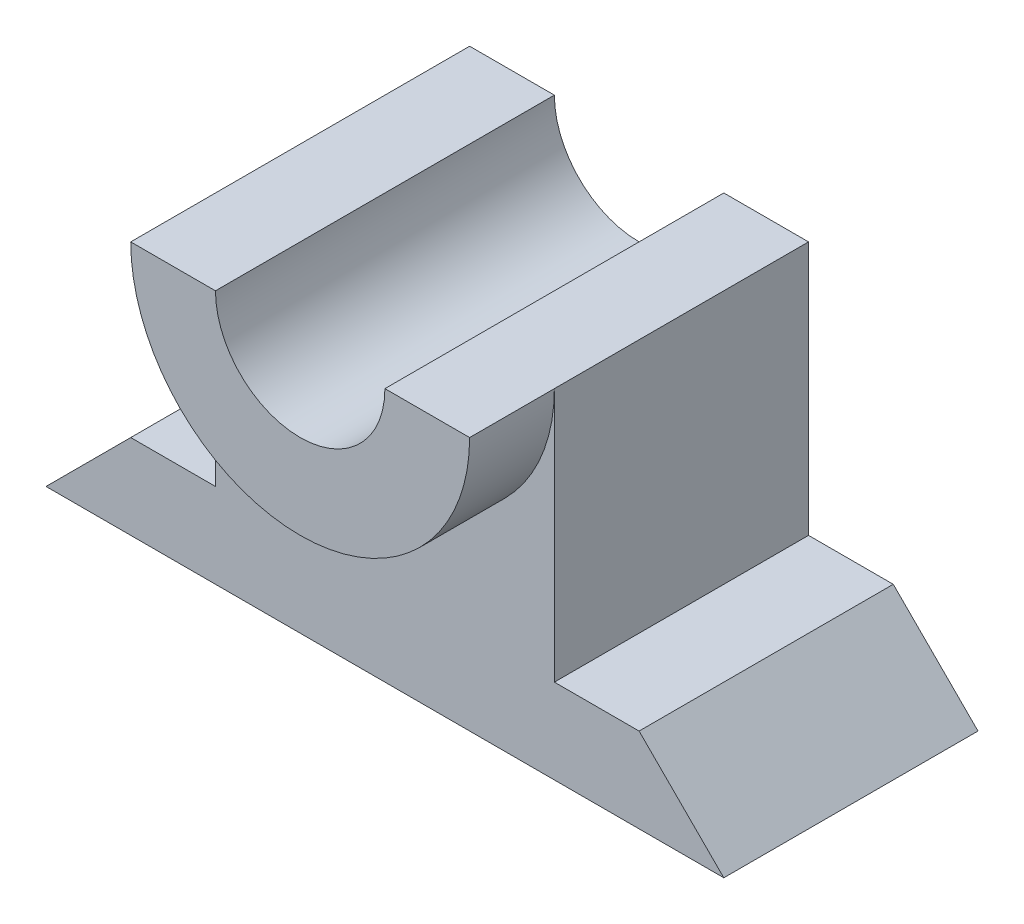
ISO-10303-21;
HEADER;
FILE_DESCRIPTION(('STEP AP214'),'2;1');
FILE_NAME('part.step','',(''),(''),'','','');
FILE_SCHEMA(('AUTOMOTIVE_DESIGN { 1 0 10303 214 1 1 1 1 }'));
ENDSEC;
DATA;
#1=APPLICATION_CONTEXT('core data for automotive mechanical design processes');
#2=APPLICATION_PROTOCOL_DEFINITION('international standard','automotive_design',2000,#1);
#3=PRODUCT_CONTEXT('',#1,'mechanical');
#4=PRODUCT('Part','Part','',(#3));
#5=PRODUCT_RELATED_PRODUCT_CATEGORY('part','',(#4));
#6=PRODUCT_DEFINITION_FORMATION('','',#4);
#7=PRODUCT_DEFINITION_CONTEXT('part definition',#1,'design');
#8=PRODUCT_DEFINITION('design','',#6,#7);
#9=PRODUCT_DEFINITION_SHAPE('','',#8);
#10=(LENGTH_UNIT() NAMED_UNIT(*) SI_UNIT(.MILLI.,.METRE.));
#11=(NAMED_UNIT(*) PLANE_ANGLE_UNIT() SI_UNIT($,.RADIAN.));
#12=(NAMED_UNIT(*) SI_UNIT($,.STERADIAN.) SOLID_ANGLE_UNIT());
#13=UNCERTAINTY_MEASURE_WITH_UNIT(LENGTH_MEASURE(1.E-05),#10,'distance_accuracy_value','');
#14=(GEOMETRIC_REPRESENTATION_CONTEXT(3) GLOBAL_UNCERTAINTY_ASSIGNED_CONTEXT((#13)) GLOBAL_UNIT_ASSIGNED_CONTEXT((#10,
#11,#12)) REPRESENTATION_CONTEXT('',''));
#15=CARTESIAN_POINT('',(0.,0.,0.));
#16=DIRECTION('',(0.,0.,1.));
#17=DIRECTION('',(1.,0.,0.));
#18=AXIS2_PLACEMENT_3D('',#15,#16,#17);
#19=CARTESIAN_POINT('',(10.,20.,15.));
#20=DIRECTION('',(0.,-1.,0.));
#21=DIRECTION('',(0.,0.,-1.));
#22=AXIS2_PLACEMENT_3D('',#19,#20,#21);
#23=PLANE('',#22);
#24=DIRECTION('',(-1.,0.,0.));
#25=VECTOR('',#24,1.);
#26=CARTESIAN_POINT('',(10.,20.,0.));
#27=LINE('',#26,#25);
#28=CARTESIAN_POINT('',(10.,20.,0.));
#29=VERTEX_POINT('',#28);
#30=CARTESIAN_POINT('',(5.,20.,0.));
#31=VERTEX_POINT('',#30);
#32=EDGE_CURVE('E195',#29,#31,#27,.T.);
#33=ORIENTED_EDGE('',*,*,#32,.T.);
#34=DIRECTION('',(0.,0.,-1.));
#35=VECTOR('',#34,1.);
#36=CARTESIAN_POINT('',(5.,20.,20.));
#37=LINE('',#36,#35);
#38=CARTESIAN_POINT('',(5.,20.,20.));
#39=VERTEX_POINT('',#38);
#40=EDGE_CURVE('E50',#39,#31,#37,.T.);
#41=ORIENTED_EDGE('',*,*,#40,.F.);
#42=DIRECTION('',(-1.,0.,0.));
#43=VECTOR('',#42,1.);
#44=CARTESIAN_POINT('',(0.,20.,20.));
#45=LINE('',#44,#43);
#46=CARTESIAN_POINT('',(10.,20.,20.));
#47=VERTEX_POINT('',#46);
#48=EDGE_CURVE('E138',#47,#39,#45,.T.);
#49=ORIENTED_EDGE('',*,*,#48,.F.);
#50=DIRECTION('',(0.,0.,-1.));
#51=VECTOR('',#50,1.);
#52=CARTESIAN_POINT('',(10.,20.,20.));
#53=LINE('',#52,#51);
#54=CARTESIAN_POINT('',(10.,20.,15.));
#55=VERTEX_POINT('',#54);
#56=EDGE_CURVE('E135',#47,#55,#53,.T.);
#57=ORIENTED_EDGE('',*,*,#56,.T.);
#58=DIRECTION('',(0.,0.,-1.));
#59=VECTOR('',#58,1.);
#60=CARTESIAN_POINT('',(10.,20.,15.));
#61=LINE('',#60,#59);
#62=EDGE_CURVE('E200',#55,#29,#61,.T.);
#63=ORIENTED_EDGE('',*,*,#62,.T.);
#64=EDGE_LOOP('',(#33,#41,#49,#57,#63));
#65=FACE_BOUND('',#64,.T.);
#66=ADVANCED_FACE('F35',(#65),#23,.F.);
#67=CARTESIAN_POINT('',(0.,0.,0.));
#68=DIRECTION('',(0.,0.,1.));
#69=DIRECTION('',(1.,0.,0.));
#70=AXIS2_PLACEMENT_3D('',#67,#68,#69);
#71=PLANE('',#70);
#72=CARTESIAN_POINT('',(0.,20.,0.));
#73=DIRECTION('',(0.,0.,1.));
#74=DIRECTION('',(1.,0.,0.));
#75=AXIS2_PLACEMENT_3D('',#72,#73,#74);
#76=CIRCLE('',#75,5.);
#77=CARTESIAN_POINT('',(-5.,20.,0.));
#78=VERTEX_POINT('',#77);
#79=EDGE_CURVE('E139',#78,#31,#76,.T.);
#80=ORIENTED_EDGE('',*,*,#79,.T.);
#81=ORIENTED_EDGE('',*,*,#32,.F.);
#82=DIRECTION('',(0.,1.,0.));
#83=VECTOR('',#82,1.);
#84=CARTESIAN_POINT('',(10.,5.,0.));
#85=LINE('',#84,#83);
#86=CARTESIAN_POINT('',(10.,5.,0.));
#87=VERTEX_POINT('',#86);
#88=EDGE_CURVE('E80',#87,#29,#85,.T.);
#89=ORIENTED_EDGE('',*,*,#88,.F.);
#90=DIRECTION('',(-1.,0.,0.));
#91=VECTOR('',#90,1.);
#92=CARTESIAN_POINT('',(15.,5.,0.));
#93=LINE('',#92,#91);
#94=CARTESIAN_POINT('',(15.,5.,0.));
#95=VERTEX_POINT('',#94);
#96=EDGE_CURVE('E204',#95,#87,#93,.T.);
#97=ORIENTED_EDGE('',*,*,#96,.F.);
#98=DIRECTION('',(-0.707106781186547,0.707106781186548,0.));
#99=VECTOR('',#98,1.);
#100=CARTESIAN_POINT('',(20.,0.,0.));
#101=LINE('',#100,#99);
#102=CARTESIAN_POINT('',(20.,0.,0.));
#103=VERTEX_POINT('',#102);
#104=EDGE_CURVE('E202',#103,#95,#101,.T.);
#105=ORIENTED_EDGE('',*,*,#104,.F.);
#106=DIRECTION('',(1.,0.,0.));
#107=VECTOR('',#106,1.);
#108=CARTESIAN_POINT('',(0.,0.,0.));
#109=LINE('',#108,#107);
#110=CARTESIAN_POINT('',(-20.,0.,0.));
#111=VERTEX_POINT('',#110);
#112=EDGE_CURVE('E192',#111,#103,#109,.T.);
#113=ORIENTED_EDGE('',*,*,#112,.F.);
#114=DIRECTION('',(0.707106781186547,0.707106781186548,0.));
#115=VECTOR('',#114,1.);
#116=CARTESIAN_POINT('',(-20.,0.,0.));
#117=LINE('',#116,#115);
#118=CARTESIAN_POINT('',(-15.,5.,0.));
#119=VERTEX_POINT('',#118);
#120=EDGE_CURVE('E154',#111,#119,#117,.T.);
#121=ORIENTED_EDGE('',*,*,#120,.T.);
#122=DIRECTION('',(1.,0.,0.));
#123=VECTOR('',#122,1.);
#124=CARTESIAN_POINT('',(-15.,5.,0.));
#125=LINE('',#124,#123);
#126=CARTESIAN_POINT('',(-10.,5.,0.));
#127=VERTEX_POINT('',#126);
#128=EDGE_CURVE('E157',#119,#127,#125,.T.);
#129=ORIENTED_EDGE('',*,*,#128,.T.);
#130=DIRECTION('',(0.,1.,0.));
#131=VECTOR('',#130,1.);
#132=CARTESIAN_POINT('',(-10.,5.,0.));
#133=LINE('',#132,#131);
#134=CARTESIAN_POINT('',(-10.,20.,0.));
#135=VERTEX_POINT('',#134);
#136=EDGE_CURVE('E173',#127,#135,#133,.T.);
#137=ORIENTED_EDGE('',*,*,#136,.T.);
#138=DIRECTION('',(1.,0.,0.));
#139=VECTOR('',#138,1.);
#140=CARTESIAN_POINT('',(-10.,20.,0.));
#141=LINE('',#140,#139);
#142=EDGE_CURVE('E165',#135,#78,#141,.T.);
#143=ORIENTED_EDGE('',*,*,#142,.T.);
#144=EDGE_LOOP('',(#80,#81,#89,#97,#105,#113,#121,#129,#137,#143));
#145=FACE_BOUND('',#144,.T.);
#146=ADVANCED_FACE('F222',(#145),#71,.F.);
#147=CARTESIAN_POINT('',(0.,0.,15.));
#148=DIRECTION('',(0.,1.,0.));
#149=DIRECTION('',(0.,0.,1.));
#150=AXIS2_PLACEMENT_3D('',#147,#148,#149);
#151=PLANE('',#150);
#152=ORIENTED_EDGE('',*,*,#112,.T.);
#153=DIRECTION('',(0.,0.,-1.));
#154=VECTOR('',#153,1.);
#155=CARTESIAN_POINT('',(20.,0.,15.));
#156=LINE('',#155,#154);
#157=CARTESIAN_POINT('',(20.,0.,15.));
#158=VERTEX_POINT('',#157);
#159=EDGE_CURVE('E11',#158,#103,#156,.T.);
#160=ORIENTED_EDGE('',*,*,#159,.F.);
#161=DIRECTION('',(1.,0.,0.));
#162=VECTOR('',#161,1.);
#163=CARTESIAN_POINT('',(0.,0.,15.));
#164=LINE('',#163,#162);
#165=CARTESIAN_POINT('',(-20.,0.,15.));
#166=VERTEX_POINT('',#165);
#167=EDGE_CURVE('E87',#166,#158,#164,.T.);
#168=ORIENTED_EDGE('',*,*,#167,.F.);
#169=DIRECTION('',(0.,0.,-1.));
#170=VECTOR('',#169,1.);
#171=CARTESIAN_POINT('',(-20.,0.,15.));
#172=LINE('',#171,#170);
#173=EDGE_CURVE('E182',#166,#111,#172,.T.);
#174=ORIENTED_EDGE('',*,*,#173,.T.);
#175=EDGE_LOOP('',(#152,#160,#168,#174));
#176=FACE_BOUND('',#175,.T.);
#177=ADVANCED_FACE('F37',(#176),#151,.F.);
#178=CARTESIAN_POINT('',(20.,0.,15.));
#179=DIRECTION('',(-0.707106781186548,-0.707106781186547,0.));
#180=DIRECTION('',(0.707106781186547,-0.707106781186548,0.));
#181=AXIS2_PLACEMENT_3D('',#178,#179,#180);
#182=PLANE('',#181);
#183=ORIENTED_EDGE('',*,*,#104,.T.);
#184=DIRECTION('',(0.,0.,-1.));
#185=VECTOR('',#184,1.);
#186=CARTESIAN_POINT('',(15.,5.,15.));
#187=LINE('',#186,#185);
#188=CARTESIAN_POINT('',(15.,5.,15.));
#189=VERTEX_POINT('',#188);
#190=EDGE_CURVE('E43',#189,#95,#187,.T.);
#191=ORIENTED_EDGE('',*,*,#190,.F.);
#192=DIRECTION('',(-0.707106781186547,0.707106781186548,0.));
#193=VECTOR('',#192,1.);
#194=CARTESIAN_POINT('',(20.,0.,15.));
#195=LINE('',#194,#193);
#196=EDGE_CURVE('E194',#158,#189,#195,.T.);
#197=ORIENTED_EDGE('',*,*,#196,.F.);
#198=ORIENTED_EDGE('',*,*,#159,.T.);
#199=EDGE_LOOP('',(#183,#191,#197,#198));
#200=FACE_BOUND('',#199,.T.);
#201=ADVANCED_FACE('F240',(#200),#182,.F.);
#202=CARTESIAN_POINT('',(15.,5.,15.));
#203=DIRECTION('',(0.,-1.,0.));
#204=DIRECTION('',(1.,0.,0.));
#205=AXIS2_PLACEMENT_3D('',#202,#203,#204);
#206=PLANE('',#205);
#207=ORIENTED_EDGE('',*,*,#96,.T.);
#208=DIRECTION('',(0.,0.,-1.));
#209=VECTOR('',#208,1.);
#210=CARTESIAN_POINT('',(10.,5.,15.));
#211=LINE('',#210,#209);
#212=CARTESIAN_POINT('',(10.,5.,15.));
#213=VERTEX_POINT('',#212);
#214=EDGE_CURVE('E210',#213,#87,#211,.T.);
#215=ORIENTED_EDGE('',*,*,#214,.F.);
#216=DIRECTION('',(-1.,0.,0.));
#217=VECTOR('',#216,1.);
#218=CARTESIAN_POINT('',(15.,5.,15.));
#219=LINE('',#218,#217);
#220=EDGE_CURVE('E197',#189,#213,#219,.T.);
#221=ORIENTED_EDGE('',*,*,#220,.F.);
#222=ORIENTED_EDGE('',*,*,#190,.T.);
#223=EDGE_LOOP('',(#207,#215,#221,#222));
#224=FACE_BOUND('',#223,.T.);
#225=ADVANCED_FACE('F216',(#224),#206,.F.);
#226=CARTESIAN_POINT('',(10.,5.,15.));
#227=DIRECTION('',(-1.,0.,0.));
#228=DIRECTION('',(0.,0.,1.));
#229=AXIS2_PLACEMENT_3D('',#226,#227,#228);
#230=PLANE('',#229);
#231=ORIENTED_EDGE('',*,*,#88,.T.);
#232=ORIENTED_EDGE('',*,*,#62,.F.);
#233=DIRECTION('',(0.,1.,0.));
#234=VECTOR('',#233,1.);
#235=CARTESIAN_POINT('',(10.,5.,15.));
#236=LINE('',#235,#234);
#237=EDGE_CURVE('E59',#213,#55,#236,.T.);
#238=ORIENTED_EDGE('',*,*,#237,.F.);
#239=ORIENTED_EDGE('',*,*,#214,.T.);
#240=EDGE_LOOP('',(#231,#232,#238,#239));
#241=FACE_BOUND('',#240,.T.);
#242=ADVANCED_FACE('F225',(#241),#230,.F.);
#243=CARTESIAN_POINT('',(0.,0.,15.));
#244=DIRECTION('',(0.,0.,1.));
#245=DIRECTION('',(1.,0.,0.));
#246=AXIS2_PLACEMENT_3D('',#243,#244,#245);
#247=PLANE('',#246);
#248=ORIENTED_EDGE('',*,*,#237,.T.);
#249=CARTESIAN_POINT('',(0.,20.,15.));
#250=DIRECTION('',(0.,0.,1.));
#251=DIRECTION('',(1.,0.,0.));
#252=AXIS2_PLACEMENT_3D('',#249,#250,#251);
#253=CIRCLE('',#252,10.);
#254=CARTESIAN_POINT('',(-10.,20.,15.));
#255=VERTEX_POINT('',#254);
#256=EDGE_CURVE('E190',#55,#255,#253,.F.);
#257=ORIENTED_EDGE('',*,*,#256,.T.);
#258=DIRECTION('',(0.,1.,0.));
#259=VECTOR('',#258,1.);
#260=CARTESIAN_POINT('',(-10.,5.,15.));
#261=LINE('',#260,#259);
#262=CARTESIAN_POINT('',(-10.,5.,15.));
#263=VERTEX_POINT('',#262);
#264=EDGE_CURVE('E168',#263,#255,#261,.T.);
#265=ORIENTED_EDGE('',*,*,#264,.F.);
#266=DIRECTION('',(1.,0.,0.));
#267=VECTOR('',#266,1.);
#268=CARTESIAN_POINT('',(-15.,5.,15.));
#269=LINE('',#268,#267);
#270=CARTESIAN_POINT('',(-15.,5.,15.));
#271=VERTEX_POINT('',#270);
#272=EDGE_CURVE('E164',#271,#263,#269,.T.);
#273=ORIENTED_EDGE('',*,*,#272,.F.);
#274=DIRECTION('',(0.707106781186547,0.707106781186548,0.));
#275=VECTOR('',#274,1.);
#276=CARTESIAN_POINT('',(-20.,0.,15.));
#277=LINE('',#276,#275);
#278=EDGE_CURVE('E161',#166,#271,#277,.T.);
#279=ORIENTED_EDGE('',*,*,#278,.F.);
#280=ORIENTED_EDGE('',*,*,#167,.T.);
#281=ORIENTED_EDGE('',*,*,#196,.T.);
#282=ORIENTED_EDGE('',*,*,#220,.T.);
#283=EDGE_LOOP('',(#248,#257,#265,#273,#279,#280,#281,#282));
#284=FACE_BOUND('',#283,.T.);
#285=ADVANCED_FACE('F226',(#284),#247,.T.);
#286=CARTESIAN_POINT('',(0.,20.,20.));
#287=DIRECTION('',(0.,0.,-1.));
#288=DIRECTION('',(-1.,0.,0.));
#289=AXIS2_PLACEMENT_3D('',#286,#287,#288);
#290=CYLINDRICAL_SURFACE('',#289,10.);
#291=ORIENTED_EDGE('',*,*,#256,.F.);
#292=ORIENTED_EDGE('',*,*,#56,.F.);
#293=CARTESIAN_POINT('',(0.,20.,20.));
#294=DIRECTION('',(0.,0.,1.));
#295=DIRECTION('',(1.,0.,0.));
#296=AXIS2_PLACEMENT_3D('',#293,#294,#295);
#297=CIRCLE('',#296,10.);
#298=CARTESIAN_POINT('',(-10.,20.,20.));
#299=VERTEX_POINT('',#298);
#300=EDGE_CURVE('E127',#299,#47,#297,.T.);
#301=ORIENTED_EDGE('',*,*,#300,.F.);
#302=DIRECTION('',(0.,0.,-1.));
#303=VECTOR('',#302,1.);
#304=CARTESIAN_POINT('',(-10.,20.,20.));
#305=LINE('',#304,#303);
#306=EDGE_CURVE('E132',#299,#255,#305,.T.);
#307=ORIENTED_EDGE('',*,*,#306,.T.);
#308=EDGE_LOOP('',(#291,#292,#301,#307));
#309=FACE_BOUND('',#308,.T.);
#310=ADVANCED_FACE('F130',(#309),#290,.T.);
#311=CARTESIAN_POINT('',(0.,20.,20.));
#312=DIRECTION('',(0.,0.,-1.));
#313=DIRECTION('',(-1.,0.,0.));
#314=AXIS2_PLACEMENT_3D('',#311,#312,#313);
#315=CYLINDRICAL_SURFACE('',#314,5.);
#316=ORIENTED_EDGE('',*,*,#40,.T.);
#317=ORIENTED_EDGE('',*,*,#79,.F.);
#318=DIRECTION('',(0.,0.,-1.));
#319=VECTOR('',#318,1.);
#320=CARTESIAN_POINT('',(-5.,20.,20.));
#321=LINE('',#320,#319);
#322=CARTESIAN_POINT('',(-5.,20.,20.));
#323=VERTEX_POINT('',#322);
#324=EDGE_CURVE('E148',#323,#78,#321,.T.);
#325=ORIENTED_EDGE('',*,*,#324,.F.);
#326=CARTESIAN_POINT('',(0.,20.,20.));
#327=DIRECTION('',(0.,0.,1.));
#328=DIRECTION('',(1.,0.,0.));
#329=AXIS2_PLACEMENT_3D('',#326,#327,#328);
#330=CIRCLE('',#329,5.);
#331=EDGE_CURVE('E144',#323,#39,#330,.T.);
#332=ORIENTED_EDGE('',*,*,#331,.T.);
#333=EDGE_LOOP('',(#316,#317,#325,#332));
#334=FACE_BOUND('',#333,.T.);
#335=ADVANCED_FACE('F262',(#334),#315,.F.);
#336=CARTESIAN_POINT('',(0.,0.,20.));
#337=DIRECTION('',(0.,0.,1.));
#338=DIRECTION('',(1.,0.,0.));
#339=AXIS2_PLACEMENT_3D('',#336,#337,#338);
#340=PLANE('',#339);
#341=ORIENTED_EDGE('',*,*,#331,.F.);
#342=DIRECTION('',(1.,0.,0.));
#343=VECTOR('',#342,1.);
#344=CARTESIAN_POINT('',(0.,20.,20.));
#345=LINE('',#344,#343);
#346=EDGE_CURVE('E142',#299,#323,#345,.T.);
#347=ORIENTED_EDGE('',*,*,#346,.F.);
#348=ORIENTED_EDGE('',*,*,#300,.T.);
#349=ORIENTED_EDGE('',*,*,#48,.T.);
#350=EDGE_LOOP('',(#341,#347,#348,#349));
#351=FACE_BOUND('',#350,.T.);
#352=ADVANCED_FACE('F143',(#351),#340,.T.);
#353=CARTESIAN_POINT('',(-10.,20.,15.));
#354=DIRECTION('',(0.,-1.,0.));
#355=DIRECTION('',(0.,0.,-1.));
#356=AXIS2_PLACEMENT_3D('',#353,#354,#355);
#357=PLANE('',#356);
#358=ORIENTED_EDGE('',*,*,#142,.F.);
#359=DIRECTION('',(0.,0.,-1.));
#360=VECTOR('',#359,1.);
#361=CARTESIAN_POINT('',(-10.,20.,15.));
#362=LINE('',#361,#360);
#363=EDGE_CURVE('E153',#255,#135,#362,.T.);
#364=ORIENTED_EDGE('',*,*,#363,.F.);
#365=ORIENTED_EDGE('',*,*,#306,.F.);
#366=ORIENTED_EDGE('',*,*,#346,.T.);
#367=ORIENTED_EDGE('',*,*,#324,.T.);
#368=EDGE_LOOP('',(#358,#364,#365,#366,#367));
#369=FACE_BOUND('',#368,.T.);
#370=ADVANCED_FACE('F151',(#369),#357,.F.);
#371=CARTESIAN_POINT('',(-20.,0.,15.));
#372=DIRECTION('',(0.707106781186548,-0.707106781186547,0.));
#373=DIRECTION('',(-0.707106781186547,-0.707106781186548,0.));
#374=AXIS2_PLACEMENT_3D('',#371,#372,#373);
#375=PLANE('',#374);
#376=ORIENTED_EDGE('',*,*,#120,.F.);
#377=ORIENTED_EDGE('',*,*,#173,.F.);
#378=ORIENTED_EDGE('',*,*,#278,.T.);
#379=DIRECTION('',(0.,0.,-1.));
#380=VECTOR('',#379,1.);
#381=CARTESIAN_POINT('',(-15.,5.,15.));
#382=LINE('',#381,#380);
#383=EDGE_CURVE('E180',#271,#119,#382,.T.);
#384=ORIENTED_EDGE('',*,*,#383,.T.);
#385=EDGE_LOOP('',(#376,#377,#378,#384));
#386=FACE_BOUND('',#385,.T.);
#387=ADVANCED_FACE('F238',(#386),#375,.F.);
#388=CARTESIAN_POINT('',(-15.,5.,15.));
#389=DIRECTION('',(0.,-1.,0.));
#390=DIRECTION('',(-1.,0.,0.));
#391=AXIS2_PLACEMENT_3D('',#388,#389,#390);
#392=PLANE('',#391);
#393=ORIENTED_EDGE('',*,*,#128,.F.);
#394=ORIENTED_EDGE('',*,*,#383,.F.);
#395=ORIENTED_EDGE('',*,*,#272,.T.);
#396=DIRECTION('',(0.,0.,-1.));
#397=VECTOR('',#396,1.);
#398=CARTESIAN_POINT('',(-10.,5.,15.));
#399=LINE('',#398,#397);
#400=EDGE_CURVE('E178',#263,#127,#399,.T.);
#401=ORIENTED_EDGE('',*,*,#400,.T.);
#402=EDGE_LOOP('',(#393,#394,#395,#401));
#403=FACE_BOUND('',#402,.T.);
#404=ADVANCED_FACE('F234',(#403),#392,.F.);
#405=CARTESIAN_POINT('',(-10.,5.,15.));
#406=DIRECTION('',(1.,0.,0.));
#407=DIRECTION('',(0.,0.,1.));
#408=AXIS2_PLACEMENT_3D('',#405,#406,#407);
#409=PLANE('',#408);
#410=ORIENTED_EDGE('',*,*,#136,.F.);
#411=ORIENTED_EDGE('',*,*,#400,.F.);
#412=ORIENTED_EDGE('',*,*,#264,.T.);
#413=ORIENTED_EDGE('',*,*,#363,.T.);
#414=EDGE_LOOP('',(#410,#411,#412,#413));
#415=FACE_BOUND('',#414,.T.);
#416=ADVANCED_FACE('F230',(#415),#409,.F.);
#417=CLOSED_SHELL('',(#66,#146,#177,#201,#225,#242,#285,#310,#335,#352,#370,#387,#404,#416));
#418=MANIFOLD_SOLID_BREP('B2',#417);
#419=ADVANCED_BREP_SHAPE_REPRESENTATION('',(#18,#418),#14);
#420=SHAPE_DEFINITION_REPRESENTATION(#9,#419);
ENDSEC;
END-ISO-10303-21;
